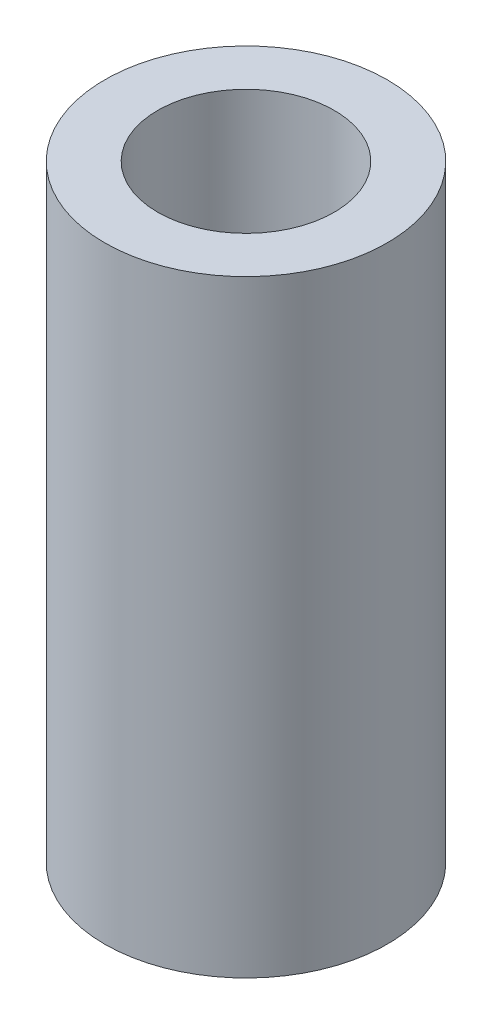
ISO-10303-21;
HEADER;
FILE_DESCRIPTION(('STEP AP214'),'2;1');
FILE_NAME('part.step','',(''),(''),'','','');
FILE_SCHEMA(('AUTOMOTIVE_DESIGN { 1 0 10303 214 1 1 1 1 }'));
ENDSEC;
DATA;
#1=APPLICATION_CONTEXT('core data for automotive mechanical design processes');
#2=APPLICATION_PROTOCOL_DEFINITION('international standard','automotive_design',2000,#1);
#3=PRODUCT_CONTEXT('',#1,'mechanical');
#4=PRODUCT('Part','Part','',(#3));
#5=PRODUCT_RELATED_PRODUCT_CATEGORY('part','',(#4));
#6=PRODUCT_DEFINITION_FORMATION('','',#4);
#7=PRODUCT_DEFINITION_CONTEXT('part definition',#1,'design');
#8=PRODUCT_DEFINITION('design','',#6,#7);
#9=PRODUCT_DEFINITION_SHAPE('','',#8);
#10=(LENGTH_UNIT() NAMED_UNIT(*) SI_UNIT(.MILLI.,.METRE.));
#11=(NAMED_UNIT(*) PLANE_ANGLE_UNIT() SI_UNIT($,.RADIAN.));
#12=(NAMED_UNIT(*) SI_UNIT($,.STERADIAN.) SOLID_ANGLE_UNIT());
#13=UNCERTAINTY_MEASURE_WITH_UNIT(LENGTH_MEASURE(1.E-05),#10,'distance_accuracy_value','');
#14=(GEOMETRIC_REPRESENTATION_CONTEXT(3) GLOBAL_UNCERTAINTY_ASSIGNED_CONTEXT((#13)) GLOBAL_UNIT_ASSIGNED_CONTEXT((#10,
#11,#12)) REPRESENTATION_CONTEXT('',''));
#15=CARTESIAN_POINT('',(0.,0.,0.));
#16=DIRECTION('',(0.,0.,1.));
#17=DIRECTION('',(1.,0.,0.));
#18=AXIS2_PLACEMENT_3D('',#15,#16,#17);
#19=CARTESIAN_POINT('',(0.,17.2,0.));
#20=DIRECTION('',(0.,1.,0.));
#21=DIRECTION('',(0.,0.,1.));
#22=AXIS2_PLACEMENT_3D('',#19,#20,#21);
#23=PLANE('',#22);
#24=CARTESIAN_POINT('',(0.,17.2,0.));
#25=DIRECTION('',(0.,1.,0.));
#26=DIRECTION('',(0.,0.,1.));
#27=AXIS2_PLACEMENT_3D('',#24,#25,#26);
#28=CIRCLE('',#27,4.);
#29=CARTESIAN_POINT('',(0.,17.2,4.));
#30=VERTEX_POINT('',#29);
#31=EDGE_CURVE('E10',#30,#30,#28,.T.);
#32=ORIENTED_EDGE('',*,*,#31,.T.);
#33=EDGE_LOOP('',(#32));
#34=FACE_BOUND('',#33,.T.);
#35=CARTESIAN_POINT('',(0.,17.2,0.));
#36=DIRECTION('',(0.,1.,0.));
#37=DIRECTION('',(0.,0.,1.));
#38=AXIS2_PLACEMENT_3D('',#35,#36,#37);
#39=CIRCLE('',#38,2.5);
#40=CARTESIAN_POINT('',(0.,17.2,2.5));
#41=VERTEX_POINT('',#40);
#42=EDGE_CURVE('E46',#41,#41,#39,.T.);
#43=ORIENTED_EDGE('',*,*,#42,.F.);
#44=EDGE_LOOP('',(#43));
#45=FACE_BOUND('',#44,.T.);
#46=ADVANCED_FACE('F35',(#34,#45),#23,.T.);
#47=CARTESIAN_POINT('',(0.,0.,0.));
#48=DIRECTION('',(0.,1.,0.));
#49=DIRECTION('',(0.,0.,1.));
#50=AXIS2_PLACEMENT_3D('',#47,#48,#49);
#51=PLANE('',#50);
#52=CARTESIAN_POINT('',(0.,0.,0.));
#53=DIRECTION('',(0.,1.,0.));
#54=DIRECTION('',(0.,0.,1.));
#55=AXIS2_PLACEMENT_3D('',#52,#53,#54);
#56=CIRCLE('',#55,4.);
#57=CARTESIAN_POINT('',(0.,0.,4.));
#58=VERTEX_POINT('',#57);
#59=EDGE_CURVE('E39',#58,#58,#56,.T.);
#60=ORIENTED_EDGE('',*,*,#59,.F.);
#61=EDGE_LOOP('',(#60));
#62=FACE_BOUND('',#61,.T.);
#63=CARTESIAN_POINT('',(0.,0.,0.));
#64=DIRECTION('',(0.,1.,0.));
#65=DIRECTION('',(0.,0.,1.));
#66=AXIS2_PLACEMENT_3D('',#63,#64,#65);
#67=CIRCLE('',#66,2.5);
#68=CARTESIAN_POINT('',(0.,0.,2.5));
#69=VERTEX_POINT('',#68);
#70=EDGE_CURVE('E48',#69,#69,#67,.T.);
#71=ORIENTED_EDGE('',*,*,#70,.T.);
#72=EDGE_LOOP('',(#71));
#73=FACE_BOUND('',#72,.T.);
#74=ADVANCED_FACE('F58',(#62,#73),#51,.F.);
#75=CARTESIAN_POINT('',(0.,17.2,0.));
#76=DIRECTION('',(0.,-1.,0.));
#77=DIRECTION('',(0.,0.,-1.));
#78=AXIS2_PLACEMENT_3D('',#75,#76,#77);
#79=CYLINDRICAL_SURFACE('',#78,4.);
#80=ORIENTED_EDGE('',*,*,#31,.F.);
#81=EDGE_LOOP('',(#80));
#82=FACE_BOUND('',#81,.T.);
#83=ORIENTED_EDGE('',*,*,#59,.T.);
#84=EDGE_LOOP('',(#83));
#85=FACE_BOUND('',#84,.T.);
#86=ADVANCED_FACE('F37',(#82,#85),#79,.T.);
#87=CARTESIAN_POINT('',(0.,17.2,0.));
#88=DIRECTION('',(0.,-1.,0.));
#89=DIRECTION('',(0.,0.,-1.));
#90=AXIS2_PLACEMENT_3D('',#87,#88,#89);
#91=CYLINDRICAL_SURFACE('',#90,2.5);
#92=ORIENTED_EDGE('',*,*,#42,.T.);
#93=EDGE_LOOP('',(#92));
#94=FACE_BOUND('',#93,.T.);
#95=ORIENTED_EDGE('',*,*,#70,.F.);
#96=EDGE_LOOP('',(#95));
#97=FACE_BOUND('',#96,.T.);
#98=ADVANCED_FACE('F54',(#94,#97),#91,.F.);
#99=CLOSED_SHELL('',(#46,#74,#86,#98));
#100=MANIFOLD_SOLID_BREP('B2',#99);
#101=ADVANCED_BREP_SHAPE_REPRESENTATION('',(#18,#100),#14);
#102=SHAPE_DEFINITION_REPRESENTATION(#9,#101);
ENDSEC;
END-ISO-10303-21;
